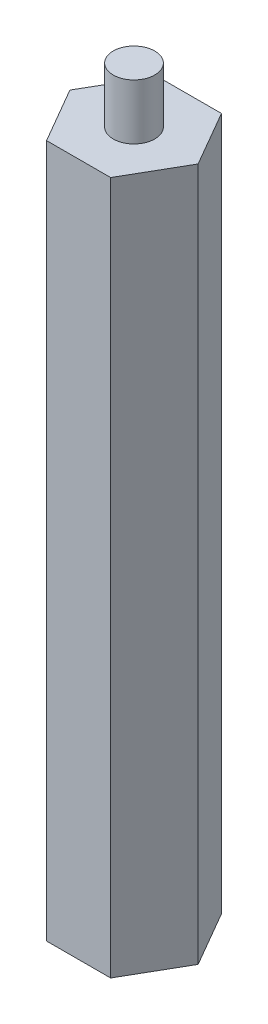
ISO-10303-21;
HEADER;
FILE_DESCRIPTION(('STEP AP214'),'2;1');
FILE_NAME('part.step','',(''),(''),'','','');
FILE_SCHEMA(('AUTOMOTIVE_DESIGN { 1 0 10303 214 1 1 1 1 }'));
ENDSEC;
DATA;
#1=APPLICATION_CONTEXT('core data for automotive mechanical design processes');
#2=APPLICATION_PROTOCOL_DEFINITION('international standard','automotive_design',2000,#1);
#3=PRODUCT_CONTEXT('',#1,'mechanical');
#4=PRODUCT('Part','Part','',(#3));
#5=PRODUCT_RELATED_PRODUCT_CATEGORY('part','',(#4));
#6=PRODUCT_DEFINITION_FORMATION('','',#4);
#7=PRODUCT_DEFINITION_CONTEXT('part definition',#1,'design');
#8=PRODUCT_DEFINITION('design','',#6,#7);
#9=PRODUCT_DEFINITION_SHAPE('','',#8);
#10=(LENGTH_UNIT() NAMED_UNIT(*) SI_UNIT(.MILLI.,.METRE.));
#11=(NAMED_UNIT(*) PLANE_ANGLE_UNIT() SI_UNIT($,.RADIAN.));
#12=(NAMED_UNIT(*) SI_UNIT($,.STERADIAN.) SOLID_ANGLE_UNIT());
#13=UNCERTAINTY_MEASURE_WITH_UNIT(LENGTH_MEASURE(1.E-05),#10,'distance_accuracy_value','');
#14=(GEOMETRIC_REPRESENTATION_CONTEXT(3) GLOBAL_UNCERTAINTY_ASSIGNED_CONTEXT((#13)) GLOBAL_UNIT_ASSIGNED_CONTEXT((#10,
#11,#12)) REPRESENTATION_CONTEXT('',''));
#15=CARTESIAN_POINT('',(0.,0.,0.));
#16=DIRECTION('',(0.,0.,1.));
#17=DIRECTION('',(1.,0.,0.));
#18=AXIS2_PLACEMENT_3D('',#15,#16,#17);
#19=CARTESIAN_POINT('',(9.23759956461125,100.,-0.00936040743649841));
#20=DIRECTION('',(-0.865518312267944,0.,0.500877281506009));
#21=DIRECTION('',(0.500877281506009,0.,0.865518312267944));
#22=AXIS2_PLACEMENT_3D('',#19,#20,#21);
#23=PLANE('',#22);
#24=DIRECTION('',(-0.500877281506009,0.,-0.865518312267944));
#25=VECTOR('',#24,1.);
#26=CARTESIAN_POINT('',(9.23759956461125,0.,-0.00936040743649841));
#27=LINE('',#26,#25);
#28=CARTESIAN_POINT('',(9.23759956461125,0.,-0.00936040743649841));
#29=VERTEX_POINT('',#28);
#30=CARTESIAN_POINT('',(4.61069343167586,0.,-8.00467609665967));
#31=VERTEX_POINT('',#30);
#32=EDGE_CURVE('E130',#29,#31,#27,.T.);
#33=ORIENTED_EDGE('',*,*,#32,.T.);
#34=DIRECTION('',(0.,-1.,0.));
#35=VECTOR('',#34,1.);
#36=CARTESIAN_POINT('',(4.61069343167586,100.,-8.00467609665967));
#37=LINE('',#36,#35);
#38=CARTESIAN_POINT('',(4.61069343167586,100.,-8.00467609665967));
#39=VERTEX_POINT('',#38);
#40=EDGE_CURVE('E42',#39,#31,#37,.T.);
#41=ORIENTED_EDGE('',*,*,#40,.F.);
#42=DIRECTION('',(-0.500877281506009,0.,-0.865518312267944));
#43=VECTOR('',#42,1.);
#44=CARTESIAN_POINT('',(9.23759956461125,100.,-0.00936040743649841));
#45=LINE('',#44,#43);
#46=CARTESIAN_POINT('',(9.23759956461125,100.,-0.00936040743649841));
#47=VERTEX_POINT('',#46);
#48=EDGE_CURVE('E147',#47,#39,#45,.T.);
#49=ORIENTED_EDGE('',*,*,#48,.F.);
#50=DIRECTION('',(0.,-1.,0.));
#51=VECTOR('',#50,1.);
#52=CARTESIAN_POINT('',(9.23759956461125,100.,-0.00936040743649841));
#53=LINE('',#52,#51);
#54=EDGE_CURVE('E126',#47,#29,#53,.T.);
#55=ORIENTED_EDGE('',*,*,#54,.T.);
#56=EDGE_LOOP('',(#33,#41,#49,#55));
#57=FACE_BOUND('',#56,.T.);
#58=ADVANCED_FACE('F39',(#57),#23,.F.);
#59=CARTESIAN_POINT('',(4.61069343167586,100.,-8.00467609665967));
#60=DIRECTION('',(0.00101329382872134,0.,0.999999486617677));
#61=DIRECTION('',(0.999999486617677,0.,-0.00101329382872134));
#62=AXIS2_PLACEMENT_3D('',#59,#60,#61);
#63=PLANE('',#62);
#64=DIRECTION('',(-0.999999486617677,0.,0.00101329382872134));
#65=VECTOR('',#64,1.);
#66=CARTESIAN_POINT('',(4.61069343167586,0.,-8.00467609665967));
#67=LINE('',#66,#65);
#68=CARTESIAN_POINT('',(-4.62690613293537,0.,-7.99531568922318));
#69=VERTEX_POINT('',#68);
#70=EDGE_CURVE('E134',#31,#69,#67,.T.);
#71=ORIENTED_EDGE('',*,*,#70,.T.);
#72=DIRECTION('',(0.,-1.,0.));
#73=VECTOR('',#72,1.);
#74=CARTESIAN_POINT('',(-4.62690613293537,100.,-7.99531568922318));
#75=LINE('',#74,#73);
#76=CARTESIAN_POINT('',(-4.62690613293537,100.,-7.99531568922318));
#77=VERTEX_POINT('',#76);
#78=EDGE_CURVE('E153',#77,#69,#75,.T.);
#79=ORIENTED_EDGE('',*,*,#78,.F.);
#80=DIRECTION('',(-0.999999486617677,0.,0.00101329382872134));
#81=VECTOR('',#80,1.);
#82=CARTESIAN_POINT('',(4.61069343167586,100.,-8.00467609665967));
#83=LINE('',#82,#81);
#84=EDGE_CURVE('E95',#39,#77,#83,.T.);
#85=ORIENTED_EDGE('',*,*,#84,.F.);
#86=ORIENTED_EDGE('',*,*,#40,.T.);
#87=EDGE_LOOP('',(#71,#79,#85,#86));
#88=FACE_BOUND('',#87,.T.);
#89=ADVANCED_FACE('F160',(#88),#63,.F.);
#90=CARTESIAN_POINT('',(-4.62690613293537,100.,-7.99531568922318));
#91=DIRECTION('',(0.866531606096666,0.,0.499122205111667));
#92=DIRECTION('',(0.499122205111667,0.,-0.866531606096666));
#93=AXIS2_PLACEMENT_3D('',#90,#91,#92);
#94=PLANE('',#93);
#95=DIRECTION('',(-0.499122205111667,0.,0.866531606096666));
#96=VECTOR('',#95,1.);
#97=CARTESIAN_POINT('',(-4.62690613293537,0.,-7.99531568922318));
#98=LINE('',#97,#96);
#99=CARTESIAN_POINT('',(-9.23759956461123,0.,0.00936040743649058));
#100=VERTEX_POINT('',#99);
#101=EDGE_CURVE('E138',#69,#100,#98,.T.);
#102=ORIENTED_EDGE('',*,*,#101,.T.);
#103=DIRECTION('',(0.,-1.,0.));
#104=VECTOR('',#103,1.);
#105=CARTESIAN_POINT('',(-9.23759956461123,100.,0.00936040743649058));
#106=LINE('',#105,#104);
#107=CARTESIAN_POINT('',(-9.23759956461123,100.,0.00936040743649058));
#108=VERTEX_POINT('',#107);
#109=EDGE_CURVE('E119',#108,#100,#106,.T.);
#110=ORIENTED_EDGE('',*,*,#109,.F.);
#111=DIRECTION('',(-0.499122205111667,0.,0.866531606096666));
#112=VECTOR('',#111,1.);
#113=CARTESIAN_POINT('',(-4.62690613293537,100.,-7.99531568922318));
#114=LINE('',#113,#112);
#115=EDGE_CURVE('E108',#77,#108,#114,.T.);
#116=ORIENTED_EDGE('',*,*,#115,.F.);
#117=ORIENTED_EDGE('',*,*,#78,.T.);
#118=EDGE_LOOP('',(#102,#110,#116,#117));
#119=FACE_BOUND('',#118,.T.);
#120=ADVANCED_FACE('F166',(#119),#94,.F.);
#121=CARTESIAN_POINT('',(-9.23759956461123,100.,0.00936040743649058));
#122=DIRECTION('',(0.865518312267944,0.,-0.500877281506009));
#123=DIRECTION('',(-0.500877281506009,0.,-0.865518312267944));
#124=AXIS2_PLACEMENT_3D('',#121,#122,#123);
#125=PLANE('',#124);
#126=DIRECTION('',(0.500877281506009,0.,0.865518312267944));
#127=VECTOR('',#126,1.);
#128=CARTESIAN_POINT('',(-9.23759956461123,0.,0.00936040743649058));
#129=LINE('',#128,#127);
#130=CARTESIAN_POINT('',(-4.61069343167583,0.,8.00467609665967));
#131=VERTEX_POINT('',#130);
#132=EDGE_CURVE('E117',#100,#131,#129,.T.);
#133=ORIENTED_EDGE('',*,*,#132,.T.);
#134=DIRECTION('',(0.,-1.,0.));
#135=VECTOR('',#134,1.);
#136=CARTESIAN_POINT('',(-4.61069343167583,100.,8.00467609665967));
#137=LINE('',#136,#135);
#138=CARTESIAN_POINT('',(-4.61069343167583,100.,8.00467609665967));
#139=VERTEX_POINT('',#138);
#140=EDGE_CURVE('E114',#139,#131,#137,.T.);
#141=ORIENTED_EDGE('',*,*,#140,.F.);
#142=DIRECTION('',(0.500877281506009,0.,0.865518312267944));
#143=VECTOR('',#142,1.);
#144=CARTESIAN_POINT('',(-9.23759956461123,100.,0.00936040743649058));
#145=LINE('',#144,#143);
#146=EDGE_CURVE('E102',#108,#139,#145,.T.);
#147=ORIENTED_EDGE('',*,*,#146,.F.);
#148=ORIENTED_EDGE('',*,*,#109,.T.);
#149=EDGE_LOOP('',(#133,#141,#147,#148));
#150=FACE_BOUND('',#149,.T.);
#151=ADVANCED_FACE('F115',(#150),#125,.F.);
#152=CARTESIAN_POINT('',(-4.61069343167583,100.,8.00467609665967));
#153=DIRECTION('',(-0.00101329382872135,0.,-0.999999486617677));
#154=DIRECTION('',(-0.999999486617677,0.,0.00101329382872135));
#155=AXIS2_PLACEMENT_3D('',#152,#153,#154);
#156=PLANE('',#155);
#157=DIRECTION('',(0.999999486617677,0.,-0.00101329382872135));
#158=VECTOR('',#157,1.);
#159=CARTESIAN_POINT('',(-4.61069343167583,0.,8.00467609665967));
#160=LINE('',#159,#158);
#161=CARTESIAN_POINT('',(4.62690613293538,0.,7.99531568922318));
#162=VERTEX_POINT('',#161);
#163=EDGE_CURVE('E80',#131,#162,#160,.T.);
#164=ORIENTED_EDGE('',*,*,#163,.T.);
#165=DIRECTION('',(0.,-1.,0.));
#166=VECTOR('',#165,1.);
#167=CARTESIAN_POINT('',(4.62690613293538,100.,7.99531568922318));
#168=LINE('',#167,#166);
#169=CARTESIAN_POINT('',(4.62690613293538,100.,7.99531568922318));
#170=VERTEX_POINT('',#169);
#171=EDGE_CURVE('E120',#170,#162,#168,.T.);
#172=ORIENTED_EDGE('',*,*,#171,.F.);
#173=DIRECTION('',(0.999999486617677,0.,-0.00101329382872135));
#174=VECTOR('',#173,1.);
#175=CARTESIAN_POINT('',(-4.61069343167583,100.,8.00467609665967));
#176=LINE('',#175,#174);
#177=EDGE_CURVE('E106',#139,#170,#176,.T.);
#178=ORIENTED_EDGE('',*,*,#177,.F.);
#179=ORIENTED_EDGE('',*,*,#140,.T.);
#180=EDGE_LOOP('',(#164,#172,#178,#179));
#181=FACE_BOUND('',#180,.T.);
#182=ADVANCED_FACE('F122',(#181),#156,.F.);
#183=CARTESIAN_POINT('',(4.62690613293538,100.,7.99531568922318));
#184=DIRECTION('',(-0.866531606096665,0.,-0.499122205111668));
#185=DIRECTION('',(-0.499122205111668,0.,0.866531606096665));
#186=AXIS2_PLACEMENT_3D('',#183,#184,#185);
#187=PLANE('',#186);
#188=DIRECTION('',(0.499122205111668,0.,-0.866531606096665));
#189=VECTOR('',#188,1.);
#190=CARTESIAN_POINT('',(4.62690613293538,0.,7.99531568922318));
#191=LINE('',#190,#189);
#192=EDGE_CURVE('E86',#162,#29,#191,.T.);
#193=ORIENTED_EDGE('',*,*,#192,.T.);
#194=ORIENTED_EDGE('',*,*,#54,.F.);
#195=DIRECTION('',(0.499122205111668,0.,-0.866531606096665));
#196=VECTOR('',#195,1.);
#197=CARTESIAN_POINT('',(4.62690613293538,100.,7.99531568922318));
#198=LINE('',#197,#196);
#199=EDGE_CURVE('E57',#170,#47,#198,.T.);
#200=ORIENTED_EDGE('',*,*,#199,.F.);
#201=ORIENTED_EDGE('',*,*,#171,.T.);
#202=EDGE_LOOP('',(#193,#194,#200,#201));
#203=FACE_BOUND('',#202,.T.);
#204=ADVANCED_FACE('F203',(#203),#187,.F.);
#205=CARTESIAN_POINT('',(0.,100.,0.));
#206=DIRECTION('',(0.,1.,0.));
#207=DIRECTION('',(0.,0.,1.));
#208=AXIS2_PLACEMENT_3D('',#205,#206,#207);
#209=PLANE('',#208);
#210=CARTESIAN_POINT('',(0.,100.,0.));
#211=DIRECTION('',(0.,1.,0.));
#212=DIRECTION('',(0.,0.,1.));
#213=AXIS2_PLACEMENT_3D('',#210,#211,#212);
#214=CIRCLE('',#213,3.);
#215=CARTESIAN_POINT('',(0.,100.,3.));
#216=VERTEX_POINT('',#215);
#217=EDGE_CURVE('E11',#216,#216,#214,.T.);
#218=ORIENTED_EDGE('',*,*,#217,.F.);
#219=EDGE_LOOP('',(#218));
#220=FACE_BOUND('',#219,.T.);
#221=ORIENTED_EDGE('',*,*,#48,.T.);
#222=ORIENTED_EDGE('',*,*,#84,.T.);
#223=ORIENTED_EDGE('',*,*,#115,.T.);
#224=ORIENTED_EDGE('',*,*,#146,.T.);
#225=ORIENTED_EDGE('',*,*,#177,.T.);
#226=ORIENTED_EDGE('',*,*,#199,.T.);
#227=EDGE_LOOP('',(#221,#222,#223,#224,#225,#226));
#228=FACE_BOUND('',#227,.T.);
#229=ADVANCED_FACE('F104',(#220,#228),#209,.T.);
#230=CARTESIAN_POINT('',(0.,0.,0.));
#231=DIRECTION('',(0.,1.,0.));
#232=DIRECTION('',(0.,0.,1.));
#233=AXIS2_PLACEMENT_3D('',#230,#231,#232);
#234=PLANE('',#233);
#235=CARTESIAN_POINT('',(0.,0.,0.));
#236=DIRECTION('',(0.,-1.,0.));
#237=DIRECTION('',(0.,0.,-1.));
#238=AXIS2_PLACEMENT_3D('',#235,#236,#237);
#239=CIRCLE('',#238,3.);
#240=CARTESIAN_POINT('',(0.,0.,-3.));
#241=VERTEX_POINT('',#240);
#242=EDGE_CURVE('E177',#241,#241,#239,.T.);
#243=ORIENTED_EDGE('',*,*,#242,.F.);
#244=EDGE_LOOP('',(#243));
#245=FACE_BOUND('',#244,.T.);
#246=ORIENTED_EDGE('',*,*,#32,.F.);
#247=ORIENTED_EDGE('',*,*,#192,.F.);
#248=ORIENTED_EDGE('',*,*,#163,.F.);
#249=ORIENTED_EDGE('',*,*,#132,.F.);
#250=ORIENTED_EDGE('',*,*,#101,.F.);
#251=ORIENTED_EDGE('',*,*,#70,.F.);
#252=EDGE_LOOP('',(#246,#247,#248,#249,#250,#251));
#253=FACE_BOUND('',#252,.T.);
#254=ADVANCED_FACE('F165',(#245,#253),#234,.F.);
#255=CARTESIAN_POINT('',(0.,108.,0.));
#256=DIRECTION('',(0.,-1.,0.));
#257=DIRECTION('',(0.,0.,-1.));
#258=AXIS2_PLACEMENT_3D('',#255,#256,#257);
#259=CYLINDRICAL_SURFACE('',#258,3.);
#260=CARTESIAN_POINT('',(0.,108.,0.));
#261=DIRECTION('',(0.,1.,0.));
#262=DIRECTION('',(0.,0.,1.));
#263=AXIS2_PLACEMENT_3D('',#260,#261,#262);
#264=CIRCLE('',#263,3.);
#265=CARTESIAN_POINT('',(0.,108.,3.));
#266=VERTEX_POINT('',#265);
#267=EDGE_CURVE('E135',#266,#266,#264,.T.);
#268=ORIENTED_EDGE('',*,*,#267,.F.);
#269=EDGE_LOOP('',(#268));
#270=FACE_BOUND('',#269,.T.);
#271=ORIENTED_EDGE('',*,*,#217,.T.);
#272=EDGE_LOOP('',(#271));
#273=FACE_BOUND('',#272,.T.);
#274=ADVANCED_FACE('F195',(#270,#273),#259,.T.);
#275=CARTESIAN_POINT('',(0.,108.,0.));
#276=DIRECTION('',(0.,1.,0.));
#277=DIRECTION('',(0.,0.,1.));
#278=AXIS2_PLACEMENT_3D('',#275,#276,#277);
#279=PLANE('',#278);
#280=ORIENTED_EDGE('',*,*,#267,.T.);
#281=EDGE_LOOP('',(#280));
#282=FACE_BOUND('',#281,.T.);
#283=ADVANCED_FACE('F190',(#282),#279,.T.);
#284=CARTESIAN_POINT('',(0.,8.,0.));
#285=DIRECTION('',(0.,-1.,0.));
#286=DIRECTION('',(0.,0.,-1.));
#287=AXIS2_PLACEMENT_3D('',#284,#285,#286);
#288=CYLINDRICAL_SURFACE('',#287,3.);
#289=CARTESIAN_POINT('',(0.,8.,0.));
#290=DIRECTION('',(0.,-1.,0.));
#291=DIRECTION('',(0.,0.,-1.));
#292=AXIS2_PLACEMENT_3D('',#289,#290,#291);
#293=CIRCLE('',#292,3.);
#294=CARTESIAN_POINT('',(0.,8.,-3.));
#295=VERTEX_POINT('',#294);
#296=EDGE_CURVE('E176',#295,#295,#293,.T.);
#297=ORIENTED_EDGE('',*,*,#296,.F.);
#298=EDGE_LOOP('',(#297));
#299=FACE_BOUND('',#298,.T.);
#300=ORIENTED_EDGE('',*,*,#242,.T.);
#301=EDGE_LOOP('',(#300));
#302=FACE_BOUND('',#301,.T.);
#303=ADVANCED_FACE('F187',(#299,#302),#288,.F.);
#304=CARTESIAN_POINT('',(0.,8.,0.));
#305=DIRECTION('',(0.,-1.,0.));
#306=DIRECTION('',(0.,0.,-1.));
#307=AXIS2_PLACEMENT_3D('',#304,#305,#306);
#308=PLANE('',#307);
#309=ORIENTED_EDGE('',*,*,#296,.T.);
#310=EDGE_LOOP('',(#309));
#311=FACE_BOUND('',#310,.T.);
#312=ADVANCED_FACE('F185',(#311),#308,.T.);
#313=CLOSED_SHELL('',(#58,#89,#120,#151,#182,#204,#229,#254,#274,#283,#303,#312));
#314=MANIFOLD_SOLID_BREP('B2',#313);
#315=ADVANCED_BREP_SHAPE_REPRESENTATION('',(#18,#314),#14);
#316=SHAPE_DEFINITION_REPRESENTATION(#9,#315);
ENDSEC;
END-ISO-10303-21;
